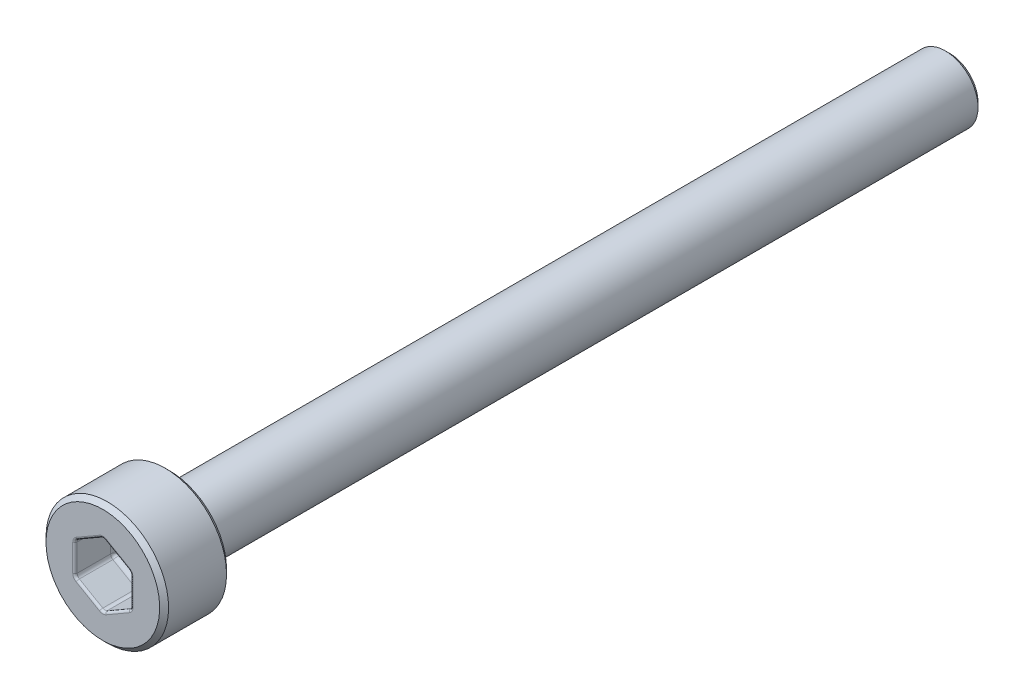
ISO-10303-21;
HEADER;
FILE_DESCRIPTION(('STEP AP214'),'2;1');
FILE_NAME('part.step','',(''),(''),'','','');
FILE_SCHEMA(('AUTOMOTIVE_DESIGN { 1 0 10303 214 1 1 1 1 }'));
ENDSEC;
DATA;
#1=APPLICATION_CONTEXT('core data for automotive mechanical design processes');
#2=APPLICATION_PROTOCOL_DEFINITION('international standard','automotive_design',2000,#1);
#3=PRODUCT_CONTEXT('',#1,'mechanical');
#4=PRODUCT('Part','Part','',(#3));
#5=PRODUCT_RELATED_PRODUCT_CATEGORY('part','',(#4));
#6=PRODUCT_DEFINITION_FORMATION('','',#4);
#7=PRODUCT_DEFINITION_CONTEXT('part definition',#1,'design');
#8=PRODUCT_DEFINITION('design','',#6,#7);
#9=PRODUCT_DEFINITION_SHAPE('','',#8);
#10=(LENGTH_UNIT() NAMED_UNIT(*) SI_UNIT(.MILLI.,.METRE.));
#11=(NAMED_UNIT(*) PLANE_ANGLE_UNIT() SI_UNIT($,.RADIAN.));
#12=(NAMED_UNIT(*) SI_UNIT($,.STERADIAN.) SOLID_ANGLE_UNIT());
#13=UNCERTAINTY_MEASURE_WITH_UNIT(LENGTH_MEASURE(1.E-05),#10,'distance_accuracy_value','');
#14=(GEOMETRIC_REPRESENTATION_CONTEXT(3) GLOBAL_UNCERTAINTY_ASSIGNED_CONTEXT((#13)) GLOBAL_UNIT_ASSIGNED_CONTEXT((#10,
#11,#12)) REPRESENTATION_CONTEXT('',''));
#15=CARTESIAN_POINT('',(0.,0.,0.));
#16=DIRECTION('',(0.,0.,1.));
#17=DIRECTION('',(1.,0.,0.));
#18=AXIS2_PLACEMENT_3D('',#15,#16,#17);
#19=CARTESIAN_POINT('',(0.,0.,3.));
#20=DIRECTION('',(0.,0.,-1.));
#21=DIRECTION('',(-1.,0.,0.));
#22=AXIS2_PLACEMENT_3D('',#19,#20,#21);
#23=PLANE('',#22);
#24=DIRECTION('',(0.,1.,0.));
#25=VECTOR('',#24,1.);
#26=CARTESIAN_POINT('',(1.35,0.,3.));
#27=LINE('',#26,#25);
#28=CARTESIAN_POINT('',(1.35,0.606217782649108,3.));
#29=VERTEX_POINT('',#28);
#30=CARTESIAN_POINT('',(1.35,-0.606217782649109,3.));
#31=VERTEX_POINT('',#30);
#32=EDGE_CURVE('E268',#29,#31,#27,.F.);
#33=ORIENTED_EDGE('',*,*,#32,.T.);
#34=CARTESIAN_POINT('',(1.05,-0.606217782649109,3.));
#35=DIRECTION('',(0.,0.,-1.));
#36=DIRECTION('',(-1.,0.,0.));
#37=AXIS2_PLACEMENT_3D('',#34,#35,#36);
#38=CIRCLE('',#37,0.3);
#39=CARTESIAN_POINT('',(1.2,-0.866025403784441,3.));
#40=VERTEX_POINT('',#39);
#41=EDGE_CURVE('E333',#31,#40,#38,.T.);
#42=ORIENTED_EDGE('',*,*,#41,.T.);
#43=DIRECTION('',(0.866025403784439,0.499999999999999,0.));
#44=VECTOR('',#43,1.);
#45=CARTESIAN_POINT('',(0.675,-1.16913429510899,3.));
#46=LINE('',#45,#44);
#47=CARTESIAN_POINT('',(0.15,-1.47224318643355,3.));
#48=VERTEX_POINT('',#47);
#49=EDGE_CURVE('E331',#40,#48,#46,.F.);
#50=ORIENTED_EDGE('',*,*,#49,.T.);
#51=CARTESIAN_POINT('',(0.,-1.21243556529821,3.));
#52=DIRECTION('',(0.,0.,-1.));
#53=DIRECTION('',(-1.,0.,0.));
#54=AXIS2_PLACEMENT_3D('',#51,#52,#53);
#55=CIRCLE('',#54,0.3);
#56=CARTESIAN_POINT('',(-0.15,-1.47224318643355,3.));
#57=VERTEX_POINT('',#56);
#58=EDGE_CURVE('E329',#48,#57,#55,.T.);
#59=ORIENTED_EDGE('',*,*,#58,.T.);
#60=DIRECTION('',(0.866025403784438,-0.500000000000001,0.));
#61=VECTOR('',#60,1.);
#62=CARTESIAN_POINT('',(-0.675000000000001,-1.16913429510899,3.));
#63=LINE('',#62,#61);
#64=CARTESIAN_POINT('',(-1.2,-0.866025403784438,3.));
#65=VERTEX_POINT('',#64);
#66=EDGE_CURVE('E327',#57,#65,#63,.F.);
#67=ORIENTED_EDGE('',*,*,#66,.T.);
#68=CARTESIAN_POINT('',(-1.05,-0.606217782649107,3.));
#69=DIRECTION('',(0.,0.,-1.));
#70=DIRECTION('',(-1.,0.,0.));
#71=AXIS2_PLACEMENT_3D('',#68,#69,#70);
#72=CIRCLE('',#71,0.3);
#73=CARTESIAN_POINT('',(-1.35,-0.606217782649107,3.));
#74=VERTEX_POINT('',#73);
#75=EDGE_CURVE('E325',#65,#74,#72,.T.);
#76=ORIENTED_EDGE('',*,*,#75,.T.);
#77=DIRECTION('',(0.,-1.,0.));
#78=VECTOR('',#77,1.);
#79=CARTESIAN_POINT('',(-1.35,0.,3.));
#80=LINE('',#79,#78);
#81=CARTESIAN_POINT('',(-1.35,0.606217782649109,3.));
#82=VERTEX_POINT('',#81);
#83=EDGE_CURVE('E323',#74,#82,#80,.F.);
#84=ORIENTED_EDGE('',*,*,#83,.T.);
#85=CARTESIAN_POINT('',(-1.05,0.606217782649109,3.));
#86=DIRECTION('',(0.,0.,-1.));
#87=DIRECTION('',(-1.,0.,0.));
#88=AXIS2_PLACEMENT_3D('',#85,#86,#87);
#89=CIRCLE('',#88,0.3);
#90=CARTESIAN_POINT('',(-1.2,0.86602540378444,3.));
#91=VERTEX_POINT('',#90);
#92=EDGE_CURVE('E321',#82,#91,#89,.T.);
#93=ORIENTED_EDGE('',*,*,#92,.T.);
#94=DIRECTION('',(-0.866025403784439,-0.5,0.));
#95=VECTOR('',#94,1.);
#96=CARTESIAN_POINT('',(-0.675,1.16913429510899,3.));
#97=LINE('',#96,#95);
#98=CARTESIAN_POINT('',(-0.149999999999999,1.47224318643355,3.));
#99=VERTEX_POINT('',#98);
#100=EDGE_CURVE('E319',#91,#99,#97,.F.);
#101=ORIENTED_EDGE('',*,*,#100,.T.);
#102=CARTESIAN_POINT('',(0.,1.21243556529822,3.));
#103=DIRECTION('',(0.,0.,-1.));
#104=DIRECTION('',(-1.,0.,0.));
#105=AXIS2_PLACEMENT_3D('',#102,#103,#104);
#106=CIRCLE('',#105,0.3);
#107=CARTESIAN_POINT('',(0.150000000000001,1.47224318643355,3.));
#108=VERTEX_POINT('',#107);
#109=EDGE_CURVE('E317',#99,#108,#106,.T.);
#110=ORIENTED_EDGE('',*,*,#109,.T.);
#111=DIRECTION('',(-0.866025403784438,0.5,0.));
#112=VECTOR('',#111,1.);
#113=CARTESIAN_POINT('',(0.675000000000001,1.16913429510899,3.));
#114=LINE('',#113,#112);
#115=CARTESIAN_POINT('',(1.2,0.86602540378444,3.));
#116=VERTEX_POINT('',#115);
#117=EDGE_CURVE('E315',#108,#116,#114,.F.);
#118=ORIENTED_EDGE('',*,*,#117,.T.);
#119=CARTESIAN_POINT('',(1.05,0.606217782649108,3.));
#120=DIRECTION('',(0.,0.,-1.));
#121=DIRECTION('',(-1.,0.,0.));
#122=AXIS2_PLACEMENT_3D('',#119,#120,#121);
#123=CIRCLE('',#122,0.3);
#124=EDGE_CURVE('E313',#116,#29,#123,.T.);
#125=ORIENTED_EDGE('',*,*,#124,.T.);
#126=EDGE_LOOP('',(#33,#42,#50,#59,#67,#76,#84,#93,#101,#110,#118,#125));
#127=FACE_BOUND('',#126,.T.);
#128=CARTESIAN_POINT('',(0.,0.,3.));
#129=DIRECTION('',(0.,0.,-1.));
#130=DIRECTION('',(-1.,0.,0.));
#131=AXIS2_PLACEMENT_3D('',#128,#129,#130);
#132=CIRCLE('',#131,2.55);
#133=CARTESIAN_POINT('',(-2.55,0.,3.));
#134=VERTEX_POINT('',#133);
#135=EDGE_CURVE('E311',#134,#134,#132,.F.);
#136=ORIENTED_EDGE('',*,*,#135,.T.);
#137=EDGE_LOOP('',(#136));
#138=FACE_BOUND('',#137,.T.);
#139=ADVANCED_FACE('F39',(#127,#138),#23,.F.);
#140=CARTESIAN_POINT('',(0.,0.,21.9198795180723));
#141=DIRECTION('',(0.,0.,1.));
#142=DIRECTION('',(1.,0.,0.));
#143=AXIS2_PLACEMENT_3D('',#140,#141,#142);
#144=CYLINDRICAL_SURFACE('',#143,2.75);
#145=CARTESIAN_POINT('',(0.,0.,2.8));
#146=DIRECTION('',(0.,0.,-1.));
#147=DIRECTION('',(-1.,0.,0.));
#148=AXIS2_PLACEMENT_3D('',#145,#146,#147);
#149=CIRCLE('',#148,2.75);
#150=CARTESIAN_POINT('',(-2.75,0.,2.8));
#151=VERTEX_POINT('',#150);
#152=EDGE_CURVE('E959',#151,#151,#149,.T.);
#153=ORIENTED_EDGE('',*,*,#152,.T.);
#154=EDGE_LOOP('',(#153));
#155=FACE_BOUND('',#154,.T.);
#156=CARTESIAN_POINT('',(0.,0.,0.200000000000002));
#157=DIRECTION('',(0.,0.,1.));
#158=DIRECTION('',(1.,0.,0.));
#159=AXIS2_PLACEMENT_3D('',#156,#157,#158);
#160=CIRCLE('',#159,2.75);
#161=CARTESIAN_POINT('',(2.75,0.,0.200000000000002));
#162=VERTEX_POINT('',#161);
#163=EDGE_CURVE('E964',#162,#162,#160,.T.);
#164=ORIENTED_EDGE('',*,*,#163,.T.);
#165=EDGE_LOOP('',(#164));
#166=FACE_BOUND('',#165,.T.);
#167=ADVANCED_FACE('F432',(#155,#166),#144,.T.);
#168=CARTESIAN_POINT('',(0.,2.75,0.));
#169=DIRECTION('',(0.,0.,1.));
#170=DIRECTION('',(1.,0.,0.));
#171=AXIS2_PLACEMENT_3D('',#168,#169,#170);
#172=PLANE('',#171);
#173=CARTESIAN_POINT('',(0.,0.,0.));
#174=DIRECTION('',(0.,0.,1.));
#175=DIRECTION('',(1.,0.,0.));
#176=AXIS2_PLACEMENT_3D('',#173,#174,#175);
#177=CIRCLE('',#176,1.665);
#178=CARTESIAN_POINT('',(1.665,0.,0.));
#179=VERTEX_POINT('',#178);
#180=EDGE_CURVE('E263',#179,#179,#177,.T.);
#181=ORIENTED_EDGE('',*,*,#180,.T.);
#182=EDGE_LOOP('',(#181));
#183=FACE_BOUND('',#182,.T.);
#184=CARTESIAN_POINT('',(0.,0.,0.));
#185=DIRECTION('',(0.,0.,1.));
#186=DIRECTION('',(1.,0.,0.));
#187=AXIS2_PLACEMENT_3D('',#184,#185,#186);
#188=CIRCLE('',#187,2.55);
#189=CARTESIAN_POINT('',(2.55,0.,0.));
#190=VERTEX_POINT('',#189);
#191=EDGE_CURVE('E957',#190,#190,#188,.F.);
#192=ORIENTED_EDGE('',*,*,#191,.T.);
#193=EDGE_LOOP('',(#192));
#194=FACE_BOUND('',#193,.T.);
#195=ADVANCED_FACE('F438',(#183,#194),#172,.F.);
#196=CARTESIAN_POINT('',(0.,0.,21.9198795180723));
#197=DIRECTION('',(0.,0.,1.));
#198=DIRECTION('',(1.,0.,0.));
#199=AXIS2_PLACEMENT_3D('',#196,#197,#198);
#200=CYLINDRICAL_SURFACE('',#199,1.465);
#201=CARTESIAN_POINT('',(0.,0.,-0.200000000000002));
#202=DIRECTION('',(0.,0.,1.));
#203=DIRECTION('',(1.,0.,0.));
#204=AXIS2_PLACEMENT_3D('',#201,#202,#203);
#205=CIRCLE('',#204,1.465);
#206=CARTESIAN_POINT('',(1.465,0.,-0.200000000000002));
#207=VERTEX_POINT('',#206);
#208=EDGE_CURVE('E266',#207,#207,#205,.F.);
#209=ORIENTED_EDGE('',*,*,#208,.T.);
#210=EDGE_LOOP('',(#209));
#211=FACE_BOUND('',#210,.T.);
#212=CARTESIAN_POINT('',(0.,0.,-34.8));
#213=DIRECTION('',(0.,0.,1.));
#214=DIRECTION('',(1.,0.,0.));
#215=AXIS2_PLACEMENT_3D('',#212,#213,#214);
#216=CIRCLE('',#215,1.465);
#217=CARTESIAN_POINT('',(1.465,0.,-34.8));
#218=VERTEX_POINT('',#217);
#219=EDGE_CURVE('E958',#218,#218,#216,.T.);
#220=ORIENTED_EDGE('',*,*,#219,.T.);
#221=EDGE_LOOP('',(#220));
#222=FACE_BOUND('',#221,.T.);
#223=ADVANCED_FACE('F890',(#211,#222),#200,.T.);
#224=CARTESIAN_POINT('',(0.,1.465,-35.));
#225=DIRECTION('',(0.,0.,1.));
#226=DIRECTION('',(1.,0.,0.));
#227=AXIS2_PLACEMENT_3D('',#224,#225,#226);
#228=PLANE('',#227);
#229=CARTESIAN_POINT('',(0.,0.,-35.));
#230=DIRECTION('',(0.,0.,1.));
#231=DIRECTION('',(1.,0.,0.));
#232=AXIS2_PLACEMENT_3D('',#229,#230,#231);
#233=CIRCLE('',#232,1.26499999999999);
#234=CARTESIAN_POINT('',(1.26499999999999,0.,-35.));
#235=VERTEX_POINT('',#234);
#236=EDGE_CURVE('E213',#235,#235,#233,.F.);
#237=ORIENTED_EDGE('',*,*,#236,.T.);
#238=EDGE_LOOP('',(#237));
#239=FACE_BOUND('',#238,.T.);
#240=ADVANCED_FACE('F880',(#239),#228,.F.);
#241=CARTESIAN_POINT('',(0.,-1.44337567297407,1.2));
#242=DIRECTION('',(0.499999999999999,-0.866025403784439,0.));
#243=DIRECTION('',(0.866025403784439,0.499999999999999,0.));
#244=AXIS2_PLACEMENT_3D('',#241,#242,#243);
#245=PLANE('',#244);
#246=DIRECTION('',(0.,0.,1.));
#247=VECTOR('',#246,1.);
#248=CARTESIAN_POINT('',(0.0999999999999997,-1.3856406460551,3.));
#249=LINE('',#248,#247);
#250=CARTESIAN_POINT('',(0.0999999999999997,-1.3856406460551,1.4));
#251=VERTEX_POINT('',#250);
#252=CARTESIAN_POINT('',(0.0999999999999997,-1.3856406460551,2.9));
#253=VERTEX_POINT('',#252);
#254=EDGE_CURVE('E260',#251,#253,#249,.T.);
#255=ORIENTED_EDGE('',*,*,#254,.T.);
#256=DIRECTION('',(0.866025403784439,0.499999999999999,0.));
#257=VECTOR('',#256,1.);
#258=CARTESIAN_POINT('',(0.,-1.44337567297407,2.9));
#259=LINE('',#258,#257);
#260=CARTESIAN_POINT('',(1.15,-0.779422863405997,2.9));
#261=VERTEX_POINT('',#260);
#262=EDGE_CURVE('E339',#253,#261,#259,.T.);
#263=ORIENTED_EDGE('',*,*,#262,.T.);
#264=DIRECTION('',(0.,0.,1.));
#265=VECTOR('',#264,1.);
#266=CARTESIAN_POINT('',(1.15,-0.779422863405997,1.2));
#267=LINE('',#266,#265);
#268=CARTESIAN_POINT('',(1.15,-0.779422863405997,1.4));
#269=VERTEX_POINT('',#268);
#270=EDGE_CURVE('E256',#261,#269,#267,.F.);
#271=ORIENTED_EDGE('',*,*,#270,.T.);
#272=DIRECTION('',(0.866025403784439,0.499999999999999,0.));
#273=VECTOR('',#272,1.);
#274=CARTESIAN_POINT('',(0.,-1.44337567297407,1.4));
#275=LINE('',#274,#273);
#276=EDGE_CURVE('E258',#269,#251,#275,.F.);
#277=ORIENTED_EDGE('',*,*,#276,.T.);
#278=EDGE_LOOP('',(#255,#263,#271,#277));
#279=FACE_BOUND('',#278,.T.);
#280=ADVANCED_FACE('F869',(#279),#245,.F.);
#281=CARTESIAN_POINT('',(-1.25,-0.721687836487032,1.2));
#282=DIRECTION('',(-0.5,-0.866025403784438,0.));
#283=DIRECTION('',(0.866025403784438,-0.500000000000001,0.));
#284=AXIS2_PLACEMENT_3D('',#281,#282,#283);
#285=PLANE('',#284);
#286=DIRECTION('',(0.,0.,1.));
#287=VECTOR('',#286,1.);
#288=CARTESIAN_POINT('',(-1.15,-0.779422863405994,3.));
#289=LINE('',#288,#287);
#290=CARTESIAN_POINT('',(-1.15,-0.779422863405994,1.4));
#291=VERTEX_POINT('',#290);
#292=CARTESIAN_POINT('',(-1.15,-0.779422863405994,2.9));
#293=VERTEX_POINT('',#292);
#294=EDGE_CURVE('E227',#291,#293,#289,.T.);
#295=ORIENTED_EDGE('',*,*,#294,.T.);
#296=DIRECTION('',(0.866025403784438,-0.500000000000001,0.));
#297=VECTOR('',#296,1.);
#298=CARTESIAN_POINT('',(-1.25,-0.721687836487032,2.9));
#299=LINE('',#298,#297);
#300=CARTESIAN_POINT('',(-0.1,-1.3856406460551,2.9));
#301=VERTEX_POINT('',#300);
#302=EDGE_CURVE('E343',#293,#301,#299,.T.);
#303=ORIENTED_EDGE('',*,*,#302,.T.);
#304=DIRECTION('',(0.,0.,1.));
#305=VECTOR('',#304,1.);
#306=CARTESIAN_POINT('',(-0.1,-1.3856406460551,1.2));
#307=LINE('',#306,#305);
#308=CARTESIAN_POINT('',(-0.1,-1.3856406460551,1.4));
#309=VERTEX_POINT('',#308);
#310=EDGE_CURVE('E219',#301,#309,#307,.F.);
#311=ORIENTED_EDGE('',*,*,#310,.T.);
#312=DIRECTION('',(0.866025403784438,-0.500000000000001,0.));
#313=VECTOR('',#312,1.);
#314=CARTESIAN_POINT('',(-1.25,-0.721687836487032,1.4));
#315=LINE('',#314,#313);
#316=EDGE_CURVE('E190',#309,#291,#315,.F.);
#317=ORIENTED_EDGE('',*,*,#316,.T.);
#318=EDGE_LOOP('',(#295,#303,#311,#317));
#319=FACE_BOUND('',#318,.T.);
#320=ADVANCED_FACE('F859',(#319),#285,.F.);
#321=CARTESIAN_POINT('',(-1.25,0.721687836487034,1.2));
#322=DIRECTION('',(-1.,0.,0.));
#323=DIRECTION('',(0.,-1.,0.));
#324=AXIS2_PLACEMENT_3D('',#321,#322,#323);
#325=PLANE('',#324);
#326=DIRECTION('',(0.,0.,1.));
#327=VECTOR('',#326,1.);
#328=CARTESIAN_POINT('',(-1.25,0.606217782649109,3.));
#329=LINE('',#328,#327);
#330=CARTESIAN_POINT('',(-1.25,0.606217782649109,1.4));
#331=VERTEX_POINT('',#330);
#332=CARTESIAN_POINT('',(-1.25,0.606217782649109,2.9));
#333=VERTEX_POINT('',#332);
#334=EDGE_CURVE('E230',#331,#333,#329,.T.);
#335=ORIENTED_EDGE('',*,*,#334,.T.);
#336=DIRECTION('',(0.,-1.,0.));
#337=VECTOR('',#336,1.);
#338=CARTESIAN_POINT('',(-1.25,0.721687836487034,2.9));
#339=LINE('',#338,#337);
#340=CARTESIAN_POINT('',(-1.25,-0.606217782649107,2.9));
#341=VERTEX_POINT('',#340);
#342=EDGE_CURVE('E347',#333,#341,#339,.T.);
#343=ORIENTED_EDGE('',*,*,#342,.T.);
#344=DIRECTION('',(0.,0.,1.));
#345=VECTOR('',#344,1.);
#346=CARTESIAN_POINT('',(-1.25,-0.606217782649107,1.2));
#347=LINE('',#346,#345);
#348=CARTESIAN_POINT('',(-1.25,-0.606217782649107,1.4));
#349=VERTEX_POINT('',#348);
#350=EDGE_CURVE('E235',#341,#349,#347,.F.);
#351=ORIENTED_EDGE('',*,*,#350,.T.);
#352=DIRECTION('',(0.,-1.,0.));
#353=VECTOR('',#352,1.);
#354=CARTESIAN_POINT('',(-1.25,0.721687836487034,1.4));
#355=LINE('',#354,#353);
#356=EDGE_CURVE('E233',#349,#331,#355,.F.);
#357=ORIENTED_EDGE('',*,*,#356,.T.);
#358=EDGE_LOOP('',(#335,#343,#351,#357));
#359=FACE_BOUND('',#358,.T.);
#360=ADVANCED_FACE('F407',(#359),#325,.F.);
#361=CARTESIAN_POINT('',(0.,1.44337567297407,1.2));
#362=DIRECTION('',(-0.5,0.866025403784439,0.));
#363=DIRECTION('',(-0.866025403784439,-0.5,0.));
#364=AXIS2_PLACEMENT_3D('',#361,#362,#363);
#365=PLANE('',#364);
#366=DIRECTION('',(0.,0.,1.));
#367=VECTOR('',#366,1.);
#368=CARTESIAN_POINT('',(-0.0999999999999993,1.3856406460551,3.));
#369=LINE('',#368,#367);
#370=CARTESIAN_POINT('',(-0.0999999999999993,1.3856406460551,1.4));
#371=VERTEX_POINT('',#370);
#372=CARTESIAN_POINT('',(-0.0999999999999993,1.3856406460551,2.9));
#373=VERTEX_POINT('',#372);
#374=EDGE_CURVE('E241',#371,#373,#369,.T.);
#375=ORIENTED_EDGE('',*,*,#374,.T.);
#376=DIRECTION('',(-0.866025403784439,-0.5,0.));
#377=VECTOR('',#376,1.);
#378=CARTESIAN_POINT('',(0.,1.44337567297407,2.9));
#379=LINE('',#378,#377);
#380=CARTESIAN_POINT('',(-1.15,0.779422863405996,2.9));
#381=VERTEX_POINT('',#380);
#382=EDGE_CURVE('E351',#373,#381,#379,.T.);
#383=ORIENTED_EDGE('',*,*,#382,.T.);
#384=DIRECTION('',(0.,0.,1.));
#385=VECTOR('',#384,1.);
#386=CARTESIAN_POINT('',(-1.15,0.779422863405996,1.2));
#387=LINE('',#386,#385);
#388=CARTESIAN_POINT('',(-1.15,0.779422863405996,1.4));
#389=VERTEX_POINT('',#388);
#390=EDGE_CURVE('E237',#381,#389,#387,.F.);
#391=ORIENTED_EDGE('',*,*,#390,.T.);
#392=DIRECTION('',(-0.866025403784439,-0.5,0.));
#393=VECTOR('',#392,1.);
#394=CARTESIAN_POINT('',(0.,1.44337567297407,1.4));
#395=LINE('',#394,#393);
#396=EDGE_CURVE('E239',#389,#371,#395,.F.);
#397=ORIENTED_EDGE('',*,*,#396,.T.);
#398=EDGE_LOOP('',(#375,#383,#391,#397));
#399=FACE_BOUND('',#398,.T.);
#400=ADVANCED_FACE('F838',(#399),#365,.F.);
#401=CARTESIAN_POINT('',(1.25,0.721687836487033,1.2));
#402=DIRECTION('',(0.5,0.866025403784438,0.));
#403=DIRECTION('',(-0.866025403784438,0.5,0.));
#404=AXIS2_PLACEMENT_3D('',#401,#402,#403);
#405=PLANE('',#404);
#406=DIRECTION('',(0.,0.,1.));
#407=VECTOR('',#406,1.);
#408=CARTESIAN_POINT('',(1.15,0.779422863405996,3.));
#409=LINE('',#408,#407);
#410=CARTESIAN_POINT('',(1.15,0.779422863405996,1.4));
#411=VERTEX_POINT('',#410);
#412=CARTESIAN_POINT('',(1.15,0.779422863405996,2.9));
#413=VERTEX_POINT('',#412);
#414=EDGE_CURVE('E248',#411,#413,#409,.T.);
#415=ORIENTED_EDGE('',*,*,#414,.T.);
#416=DIRECTION('',(-0.866025403784438,0.5,0.));
#417=VECTOR('',#416,1.);
#418=CARTESIAN_POINT('',(1.25,0.721687836487033,2.9));
#419=LINE('',#418,#417);
#420=CARTESIAN_POINT('',(0.100000000000001,1.3856406460551,2.9));
#421=VERTEX_POINT('',#420);
#422=EDGE_CURVE('E355',#413,#421,#419,.T.);
#423=ORIENTED_EDGE('',*,*,#422,.T.);
#424=DIRECTION('',(0.,0.,1.));
#425=VECTOR('',#424,1.);
#426=CARTESIAN_POINT('',(0.100000000000001,1.3856406460551,1.2));
#427=LINE('',#426,#425);
#428=CARTESIAN_POINT('',(0.100000000000001,1.3856406460551,1.4));
#429=VERTEX_POINT('',#428);
#430=EDGE_CURVE('E244',#421,#429,#427,.F.);
#431=ORIENTED_EDGE('',*,*,#430,.T.);
#432=DIRECTION('',(-0.866025403784438,0.5,0.));
#433=VECTOR('',#432,1.);
#434=CARTESIAN_POINT('',(1.25,0.721687836487033,1.4));
#435=LINE('',#434,#433);
#436=EDGE_CURVE('E246',#429,#411,#435,.F.);
#437=ORIENTED_EDGE('',*,*,#436,.T.);
#438=EDGE_LOOP('',(#415,#423,#431,#437));
#439=FACE_BOUND('',#438,.T.);
#440=ADVANCED_FACE('F828',(#439),#405,.F.);
#441=CARTESIAN_POINT('',(1.25,-0.721687836487034,1.2));
#442=DIRECTION('',(1.,0.,0.));
#443=DIRECTION('',(0.,1.,0.));
#444=AXIS2_PLACEMENT_3D('',#441,#442,#443);
#445=PLANE('',#444);
#446=DIRECTION('',(0.,0.,1.));
#447=VECTOR('',#446,1.);
#448=CARTESIAN_POINT('',(1.25,-0.606217782649109,3.));
#449=LINE('',#448,#447);
#450=CARTESIAN_POINT('',(1.25,-0.606217782649109,1.4));
#451=VERTEX_POINT('',#450);
#452=CARTESIAN_POINT('',(1.25,-0.606217782649109,2.9));
#453=VERTEX_POINT('',#452);
#454=EDGE_CURVE('E254',#451,#453,#449,.T.);
#455=ORIENTED_EDGE('',*,*,#454,.T.);
#456=DIRECTION('',(0.,1.,0.));
#457=VECTOR('',#456,1.);
#458=CARTESIAN_POINT('',(1.25,-0.721687836487034,2.9));
#459=LINE('',#458,#457);
#460=CARTESIAN_POINT('',(1.25,0.606217782649108,2.9));
#461=VERTEX_POINT('',#460);
#462=EDGE_CURVE('E11',#453,#461,#459,.T.);
#463=ORIENTED_EDGE('',*,*,#462,.T.);
#464=DIRECTION('',(0.,0.,1.));
#465=VECTOR('',#464,1.);
#466=CARTESIAN_POINT('',(1.25,0.606217782649108,1.2));
#467=LINE('',#466,#465);
#468=CARTESIAN_POINT('',(1.25,0.606217782649108,1.4));
#469=VERTEX_POINT('',#468);
#470=EDGE_CURVE('E250',#461,#469,#467,.F.);
#471=ORIENTED_EDGE('',*,*,#470,.T.);
#472=DIRECTION('',(0.,1.,0.));
#473=VECTOR('',#472,1.);
#474=CARTESIAN_POINT('',(1.25,-0.721687836487034,1.4));
#475=LINE('',#474,#473);
#476=EDGE_CURVE('E252',#469,#451,#475,.F.);
#477=ORIENTED_EDGE('',*,*,#476,.T.);
#478=EDGE_LOOP('',(#455,#463,#471,#477));
#479=FACE_BOUND('',#478,.T.);
#480=ADVANCED_FACE('F818',(#479),#445,.F.);
#481=CARTESIAN_POINT('',(0.,0.,1.2));
#482=DIRECTION('',(0.,0.,1.));
#483=DIRECTION('',(1.,0.,0.));
#484=AXIS2_PLACEMENT_3D('',#481,#482,#483);
#485=PLANE('',#484);
#486=DIRECTION('',(0.,-1.,0.));
#487=VECTOR('',#486,1.);
#488=CARTESIAN_POINT('',(-1.05,0.,1.2));
#489=LINE('',#488,#487);
#490=CARTESIAN_POINT('',(-1.05,0.606217782649109,1.2));
#491=VERTEX_POINT('',#490);
#492=CARTESIAN_POINT('',(-1.05,-0.606217782649107,1.2));
#493=VERTEX_POINT('',#492);
#494=EDGE_CURVE('E217',#491,#493,#489,.T.);
#495=ORIENTED_EDGE('',*,*,#494,.T.);
#496=DIRECTION('',(0.866025403784438,-0.500000000000001,0.));
#497=VECTOR('',#496,1.);
#498=CARTESIAN_POINT('',(-0.525000000000001,-0.909326673973661,1.2));
#499=LINE('',#498,#497);
#500=CARTESIAN_POINT('',(0.,-1.21243556529822,1.2));
#501=VERTEX_POINT('',#500);
#502=EDGE_CURVE('E188',#493,#501,#499,.T.);
#503=ORIENTED_EDGE('',*,*,#502,.T.);
#504=DIRECTION('',(0.866025403784439,0.499999999999999,0.));
#505=VECTOR('',#504,1.);
#506=CARTESIAN_POINT('',(0.525,-0.909326673973662,1.2));
#507=LINE('',#506,#505);
#508=CARTESIAN_POINT('',(1.05,-0.606217782649109,1.2));
#509=VERTEX_POINT('',#508);
#510=EDGE_CURVE('E206',#501,#509,#507,.T.);
#511=ORIENTED_EDGE('',*,*,#510,.T.);
#512=DIRECTION('',(0.,1.,0.));
#513=VECTOR('',#512,1.);
#514=CARTESIAN_POINT('',(1.05,0.,1.2));
#515=LINE('',#514,#513);
#516=CARTESIAN_POINT('',(1.05,0.606217782649108,1.2));
#517=VERTEX_POINT('',#516);
#518=EDGE_CURVE('E212',#509,#517,#515,.T.);
#519=ORIENTED_EDGE('',*,*,#518,.T.);
#520=DIRECTION('',(-0.866025403784438,0.5,0.));
#521=VECTOR('',#520,1.);
#522=CARTESIAN_POINT('',(0.525000000000001,0.909326673973661,1.2));
#523=LINE('',#522,#521);
#524=CARTESIAN_POINT('',(0.,1.21243556529822,1.2));
#525=VERTEX_POINT('',#524);
#526=EDGE_CURVE('E971',#517,#525,#523,.T.);
#527=ORIENTED_EDGE('',*,*,#526,.T.);
#528=DIRECTION('',(-0.866025403784439,-0.5,0.));
#529=VECTOR('',#528,1.);
#530=CARTESIAN_POINT('',(-0.525,0.909326673973662,1.2));
#531=LINE('',#530,#529);
#532=EDGE_CURVE('E222',#525,#491,#531,.T.);
#533=ORIENTED_EDGE('',*,*,#532,.T.);
#534=EDGE_LOOP('',(#495,#503,#511,#519,#527,#533));
#535=FACE_BOUND('',#534,.T.);
#536=ADVANCED_FACE('F215',(#535),#485,.T.);
#537=CARTESIAN_POINT('',(0.,0.,3.));
#538=DIRECTION('',(0.,0.,-1.));
#539=DIRECTION('',(-1.,0.,0.));
#540=AXIS2_PLACEMENT_3D('',#537,#538,#539);
#541=CONICAL_SURFACE('',#540,2.55,0.785398163397442);
#542=ORIENTED_EDGE('',*,*,#152,.F.);
#543=EDGE_LOOP('',(#542));
#544=FACE_BOUND('',#543,.T.);
#545=ORIENTED_EDGE('',*,*,#135,.F.);
#546=EDGE_LOOP('',(#545));
#547=FACE_BOUND('',#546,.T.);
#548=ADVANCED_FACE('F444',(#544,#547),#541,.T.);
#549=CARTESIAN_POINT('',(0.,0.,0.200000000000002));
#550=DIRECTION('',(0.,0.,1.));
#551=DIRECTION('',(1.,0.,0.));
#552=AXIS2_PLACEMENT_3D('',#549,#550,#551);
#553=CONICAL_SURFACE('',#552,2.75,0.78539816339745);
#554=ORIENTED_EDGE('',*,*,#191,.F.);
#555=EDGE_LOOP('',(#554));
#556=FACE_BOUND('',#555,.T.);
#557=ORIENTED_EDGE('',*,*,#163,.F.);
#558=EDGE_LOOP('',(#557));
#559=FACE_BOUND('',#558,.T.);
#560=ADVANCED_FACE('F447',(#556,#559),#553,.T.);
#561=CARTESIAN_POINT('',(0.,0.,-34.8));
#562=DIRECTION('',(0.,0.,1.));
#563=DIRECTION('',(1.,0.,0.));
#564=AXIS2_PLACEMENT_3D('',#561,#562,#563);
#565=CONICAL_SURFACE('',#564,1.465,0.785398163397429);
#566=ORIENTED_EDGE('',*,*,#236,.F.);
#567=EDGE_LOOP('',(#566));
#568=FACE_BOUND('',#567,.T.);
#569=ORIENTED_EDGE('',*,*,#219,.F.);
#570=EDGE_LOOP('',(#569));
#571=FACE_BOUND('',#570,.T.);
#572=ADVANCED_FACE('F451',(#568,#571),#565,.T.);
#573=CARTESIAN_POINT('',(0.,1.21243556529822,1.2));
#574=DIRECTION('',(0.,0.,-1.));
#575=DIRECTION('',(-1.,0.,0.));
#576=AXIS2_PLACEMENT_3D('',#573,#574,#575);
#577=CYLINDRICAL_SURFACE('',#576,0.2);
#578=ORIENTED_EDGE('',*,*,#430,.F.);
#579=CARTESIAN_POINT('',(0.,1.21243556529822,2.9));
#580=DIRECTION('',(0.,0.,-1.));
#581=DIRECTION('',(-1.,0.,0.));
#582=AXIS2_PLACEMENT_3D('',#579,#580,#581);
#583=CIRCLE('',#582,0.2);
#584=EDGE_CURVE('E353',#421,#373,#583,.F.);
#585=ORIENTED_EDGE('',*,*,#584,.T.);
#586=ORIENTED_EDGE('',*,*,#374,.F.);
#587=CARTESIAN_POINT('',(0.,1.21243556529822,1.4));
#588=DIRECTION('',(0.,0.,1.));
#589=DIRECTION('',(1.,0.,0.));
#590=AXIS2_PLACEMENT_3D('',#587,#588,#589);
#591=CIRCLE('',#590,0.2);
#592=EDGE_CURVE('E308',#429,#371,#591,.T.);
#593=ORIENTED_EDGE('',*,*,#592,.F.);
#594=EDGE_LOOP('',(#578,#585,#586,#593));
#595=FACE_BOUND('',#594,.T.);
#596=ADVANCED_FACE('F455',(#595),#577,.F.);
#597=CARTESIAN_POINT('',(0.525000000000001,0.909326673973661,1.4));
#598=DIRECTION('',(-0.866025403784438,0.5,0.));
#599=DIRECTION('',(-0.5,-0.866025403784438,0.));
#600=AXIS2_PLACEMENT_3D('',#597,#598,#599);
#601=CYLINDRICAL_SURFACE('',#600,0.2);
#602=CARTESIAN_POINT('',(1.05,0.606217782649108,1.4));
#603=DIRECTION('',(-0.866025403784438,0.5,0.));
#604=DIRECTION('',(-0.5,-0.866025403784439,0.));
#605=AXIS2_PLACEMENT_3D('',#602,#603,#604);
#606=CIRCLE('',#605,0.2);
#607=EDGE_CURVE('E302',#411,#517,#606,.T.);
#608=ORIENTED_EDGE('',*,*,#607,.F.);
#609=ORIENTED_EDGE('',*,*,#436,.F.);
#610=CARTESIAN_POINT('',(0.,1.21243556529822,1.4));
#611=DIRECTION('',(0.866025403784438,-0.500000000000001,0.));
#612=DIRECTION('',(0.500000000000001,0.866025403784438,0.));
#613=AXIS2_PLACEMENT_3D('',#610,#611,#612);
#614=CIRCLE('',#613,0.2);
#615=EDGE_CURVE('E305',#525,#429,#614,.T.);
#616=ORIENTED_EDGE('',*,*,#615,.F.);
#617=ORIENTED_EDGE('',*,*,#526,.F.);
#618=EDGE_LOOP('',(#608,#609,#616,#617));
#619=FACE_BOUND('',#618,.T.);
#620=ADVANCED_FACE('F767',(#619),#601,.F.);
#621=CARTESIAN_POINT('',(1.05,0.606217782649108,1.2));
#622=DIRECTION('',(0.,0.,-1.));
#623=DIRECTION('',(-1.,0.,0.));
#624=AXIS2_PLACEMENT_3D('',#621,#622,#623);
#625=CYLINDRICAL_SURFACE('',#624,0.2);
#626=ORIENTED_EDGE('',*,*,#470,.F.);
#627=CARTESIAN_POINT('',(1.05,0.606217782649108,2.9));
#628=DIRECTION('',(0.,0.,-1.));
#629=DIRECTION('',(-1.,0.,0.));
#630=AXIS2_PLACEMENT_3D('',#627,#628,#629);
#631=CIRCLE('',#630,0.2);
#632=EDGE_CURVE('E48',#461,#413,#631,.F.);
#633=ORIENTED_EDGE('',*,*,#632,.T.);
#634=ORIENTED_EDGE('',*,*,#414,.F.);
#635=CARTESIAN_POINT('',(1.05,0.606217782649108,1.4));
#636=DIRECTION('',(0.,0.,1.));
#637=DIRECTION('',(1.,0.,0.));
#638=AXIS2_PLACEMENT_3D('',#635,#636,#637);
#639=CIRCLE('',#638,0.2);
#640=EDGE_CURVE('E299',#469,#411,#639,.T.);
#641=ORIENTED_EDGE('',*,*,#640,.F.);
#642=EDGE_LOOP('',(#626,#633,#634,#641));
#643=FACE_BOUND('',#642,.T.);
#644=ADVANCED_FACE('F756',(#643),#625,.F.);
#645=CARTESIAN_POINT('',(0.,1.21243556529822,1.4));
#646=DIRECTION('',(0.,0.,1.));
#647=DIRECTION('',(1.,0.,0.));
#648=AXIS2_PLACEMENT_3D('',#645,#646,#647);
#649=SPHERICAL_SURFACE('',#648,0.2);
#650=ORIENTED_EDGE('',*,*,#615,.T.);
#651=ORIENTED_EDGE('',*,*,#592,.T.);
#652=CARTESIAN_POINT('',(0.,1.21243556529822,1.4));
#653=DIRECTION('',(-0.866025403784439,-0.5,0.));
#654=DIRECTION('',(0.5,-0.866025403784439,0.));
#655=AXIS2_PLACEMENT_3D('',#652,#653,#654);
#656=CIRCLE('',#655,0.2);
#657=EDGE_CURVE('E296',#525,#371,#656,.F.);
#658=ORIENTED_EDGE('',*,*,#657,.F.);
#659=EDGE_LOOP('',(#650,#651,#658));
#660=FACE_BOUND('',#659,.T.);
#661=ADVANCED_FACE('F745',(#660),#649,.F.);
#662=CARTESIAN_POINT('',(1.05,0.606217782649108,1.4));
#663=DIRECTION('',(0.,0.,1.));
#664=DIRECTION('',(1.,0.,0.));
#665=AXIS2_PLACEMENT_3D('',#662,#663,#664);
#666=SPHERICAL_SURFACE('',#665,0.2);
#667=ORIENTED_EDGE('',*,*,#640,.T.);
#668=ORIENTED_EDGE('',*,*,#607,.T.);
#669=CARTESIAN_POINT('',(1.05,0.606217782649108,1.4));
#670=DIRECTION('',(0.,-1.,0.));
#671=DIRECTION('',(0.,0.,-1.));
#672=AXIS2_PLACEMENT_3D('',#669,#670,#671);
#673=CIRCLE('',#672,0.2);
#674=EDGE_CURVE('E293',#469,#517,#673,.F.);
#675=ORIENTED_EDGE('',*,*,#674,.F.);
#676=EDGE_LOOP('',(#667,#668,#675));
#677=FACE_BOUND('',#676,.T.);
#678=ADVANCED_FACE('F735',(#677),#666,.F.);
#679=CARTESIAN_POINT('',(-1.05,0.606217782649109,1.2));
#680=DIRECTION('',(0.,0.,-1.));
#681=DIRECTION('',(-1.,0.,0.));
#682=AXIS2_PLACEMENT_3D('',#679,#680,#681);
#683=CYLINDRICAL_SURFACE('',#682,0.2);
#684=ORIENTED_EDGE('',*,*,#390,.F.);
#685=CARTESIAN_POINT('',(-1.05,0.606217782649109,2.9));
#686=DIRECTION('',(0.,0.,-1.));
#687=DIRECTION('',(-1.,0.,0.));
#688=AXIS2_PLACEMENT_3D('',#685,#686,#687);
#689=CIRCLE('',#688,0.2);
#690=EDGE_CURVE('E349',#381,#333,#689,.F.);
#691=ORIENTED_EDGE('',*,*,#690,.T.);
#692=ORIENTED_EDGE('',*,*,#334,.F.);
#693=CARTESIAN_POINT('',(-1.05,0.606217782649109,1.4));
#694=DIRECTION('',(0.,0.,1.));
#695=DIRECTION('',(1.,0.,0.));
#696=AXIS2_PLACEMENT_3D('',#693,#694,#695);
#697=CIRCLE('',#696,0.2);
#698=EDGE_CURVE('E290',#389,#331,#697,.T.);
#699=ORIENTED_EDGE('',*,*,#698,.F.);
#700=EDGE_LOOP('',(#684,#691,#692,#699));
#701=FACE_BOUND('',#700,.T.);
#702=ADVANCED_FACE('F404',(#701),#683,.F.);
#703=CARTESIAN_POINT('',(-0.525,0.909326673973662,1.4));
#704=DIRECTION('',(-0.866025403784439,-0.5,0.));
#705=DIRECTION('',(0.5,-0.866025403784439,0.));
#706=AXIS2_PLACEMENT_3D('',#703,#704,#705);
#707=CYLINDRICAL_SURFACE('',#706,0.2);
#708=ORIENTED_EDGE('',*,*,#657,.T.);
#709=ORIENTED_EDGE('',*,*,#396,.F.);
#710=CARTESIAN_POINT('',(-1.05,0.606217782649109,1.4));
#711=DIRECTION('',(0.866025403784438,0.5,0.));
#712=DIRECTION('',(-0.5,0.866025403784438,0.));
#713=AXIS2_PLACEMENT_3D('',#710,#711,#712);
#714=CIRCLE('',#713,0.2);
#715=EDGE_CURVE('E287',#491,#389,#714,.T.);
#716=ORIENTED_EDGE('',*,*,#715,.F.);
#717=ORIENTED_EDGE('',*,*,#532,.F.);
#718=EDGE_LOOP('',(#708,#709,#716,#717));
#719=FACE_BOUND('',#718,.T.);
#720=ADVANCED_FACE('F714',(#719),#707,.F.);
#721=CARTESIAN_POINT('',(1.05,0.,1.4));
#722=DIRECTION('',(0.,1.,0.));
#723=DIRECTION('',(-1.,0.,0.));
#724=AXIS2_PLACEMENT_3D('',#721,#722,#723);
#725=CYLINDRICAL_SURFACE('',#724,0.2);
#726=ORIENTED_EDGE('',*,*,#674,.T.);
#727=ORIENTED_EDGE('',*,*,#518,.F.);
#728=CARTESIAN_POINT('',(1.05,-0.606217782649109,1.4));
#729=DIRECTION('',(0.,1.,0.));
#730=DIRECTION('',(0.,0.,1.));
#731=AXIS2_PLACEMENT_3D('',#728,#729,#730);
#732=CIRCLE('',#731,0.2);
#733=EDGE_CURVE('E284',#451,#509,#732,.T.);
#734=ORIENTED_EDGE('',*,*,#733,.F.);
#735=ORIENTED_EDGE('',*,*,#476,.F.);
#736=EDGE_LOOP('',(#726,#727,#734,#735));
#737=FACE_BOUND('',#736,.T.);
#738=ADVANCED_FACE('F703',(#737),#725,.F.);
#739=CARTESIAN_POINT('',(1.05,-0.606217782649109,1.2));
#740=DIRECTION('',(0.,0.,-1.));
#741=DIRECTION('',(-1.,0.,0.));
#742=AXIS2_PLACEMENT_3D('',#739,#740,#741);
#743=CYLINDRICAL_SURFACE('',#742,0.2);
#744=ORIENTED_EDGE('',*,*,#270,.F.);
#745=CARTESIAN_POINT('',(1.05,-0.606217782649109,2.9));
#746=DIRECTION('',(0.,0.,-1.));
#747=DIRECTION('',(-1.,0.,0.));
#748=AXIS2_PLACEMENT_3D('',#745,#746,#747);
#749=CIRCLE('',#748,0.2);
#750=EDGE_CURVE('E336',#261,#453,#749,.F.);
#751=ORIENTED_EDGE('',*,*,#750,.T.);
#752=ORIENTED_EDGE('',*,*,#454,.F.);
#753=CARTESIAN_POINT('',(1.05,-0.606217782649109,1.4));
#754=DIRECTION('',(0.,0.,1.));
#755=DIRECTION('',(1.,0.,0.));
#756=AXIS2_PLACEMENT_3D('',#753,#754,#755);
#757=CIRCLE('',#756,0.2);
#758=EDGE_CURVE('E281',#269,#451,#757,.T.);
#759=ORIENTED_EDGE('',*,*,#758,.F.);
#760=EDGE_LOOP('',(#744,#751,#752,#759));
#761=FACE_BOUND('',#760,.T.);
#762=ADVANCED_FACE('F692',(#761),#743,.F.);
#763=CARTESIAN_POINT('',(-1.05,0.606217782649109,1.4));
#764=DIRECTION('',(0.,0.,1.));
#765=DIRECTION('',(1.,0.,0.));
#766=AXIS2_PLACEMENT_3D('',#763,#764,#765);
#767=SPHERICAL_SURFACE('',#766,0.2);
#768=ORIENTED_EDGE('',*,*,#715,.T.);
#769=ORIENTED_EDGE('',*,*,#698,.T.);
#770=CARTESIAN_POINT('',(-1.05,0.606217782649109,1.4));
#771=DIRECTION('',(0.,-1.,0.));
#772=DIRECTION('',(0.,0.,-1.));
#773=AXIS2_PLACEMENT_3D('',#770,#771,#772);
#774=CIRCLE('',#773,0.2);
#775=EDGE_CURVE('E278',#491,#331,#774,.F.);
#776=ORIENTED_EDGE('',*,*,#775,.F.);
#777=EDGE_LOOP('',(#768,#769,#776));
#778=FACE_BOUND('',#777,.T.);
#779=ADVANCED_FACE('F681',(#778),#767,.F.);
#780=CARTESIAN_POINT('',(1.05,-0.606217782649109,1.4));
#781=DIRECTION('',(0.,0.,1.));
#782=DIRECTION('',(1.,0.,0.));
#783=AXIS2_PLACEMENT_3D('',#780,#781,#782);
#784=SPHERICAL_SURFACE('',#783,0.2);
#785=ORIENTED_EDGE('',*,*,#758,.T.);
#786=ORIENTED_EDGE('',*,*,#733,.T.);
#787=CARTESIAN_POINT('',(1.05,-0.606217782649109,1.4));
#788=DIRECTION('',(-0.866025403784439,-0.5,0.));
#789=DIRECTION('',(0.5,-0.866025403784439,0.));
#790=AXIS2_PLACEMENT_3D('',#787,#788,#789);
#791=CIRCLE('',#790,0.2);
#792=EDGE_CURVE('E209',#269,#509,#791,.F.);
#793=ORIENTED_EDGE('',*,*,#792,.F.);
#794=EDGE_LOOP('',(#785,#786,#793));
#795=FACE_BOUND('',#794,.T.);
#796=ADVANCED_FACE('F671',(#795),#784,.F.);
#797=CARTESIAN_POINT('',(-1.05,-0.606217782649107,1.2));
#798=DIRECTION('',(0.,0.,-1.));
#799=DIRECTION('',(-1.,0.,0.));
#800=AXIS2_PLACEMENT_3D('',#797,#798,#799);
#801=CYLINDRICAL_SURFACE('',#800,0.2);
#802=ORIENTED_EDGE('',*,*,#350,.F.);
#803=CARTESIAN_POINT('',(-1.05,-0.606217782649107,2.9));
#804=DIRECTION('',(0.,0.,-1.));
#805=DIRECTION('',(-1.,0.,0.));
#806=AXIS2_PLACEMENT_3D('',#803,#804,#805);
#807=CIRCLE('',#806,0.2);
#808=EDGE_CURVE('E345',#341,#293,#807,.F.);
#809=ORIENTED_EDGE('',*,*,#808,.T.);
#810=ORIENTED_EDGE('',*,*,#294,.F.);
#811=CARTESIAN_POINT('',(-1.05,-0.606217782649107,1.4));
#812=DIRECTION('',(0.,0.,1.));
#813=DIRECTION('',(1.,0.,0.));
#814=AXIS2_PLACEMENT_3D('',#811,#812,#813);
#815=CIRCLE('',#814,0.2);
#816=EDGE_CURVE('E274',#349,#291,#815,.T.);
#817=ORIENTED_EDGE('',*,*,#816,.F.);
#818=EDGE_LOOP('',(#802,#809,#810,#817));
#819=FACE_BOUND('',#818,.T.);
#820=ADVANCED_FACE('F417',(#819),#801,.F.);
#821=CARTESIAN_POINT('',(-1.05,0.,1.4));
#822=DIRECTION('',(0.,-1.,0.));
#823=DIRECTION('',(1.,0.,0.));
#824=AXIS2_PLACEMENT_3D('',#821,#822,#823);
#825=CYLINDRICAL_SURFACE('',#824,0.2);
#826=ORIENTED_EDGE('',*,*,#775,.T.);
#827=ORIENTED_EDGE('',*,*,#356,.F.);
#828=CARTESIAN_POINT('',(-1.05,-0.606217782649107,1.4));
#829=DIRECTION('',(0.,1.,0.));
#830=DIRECTION('',(-1.,0.,0.));
#831=AXIS2_PLACEMENT_3D('',#828,#829,#830);
#832=CIRCLE('',#831,0.2);
#833=EDGE_CURVE('E203',#493,#349,#832,.T.);
#834=ORIENTED_EDGE('',*,*,#833,.F.);
#835=ORIENTED_EDGE('',*,*,#494,.F.);
#836=EDGE_LOOP('',(#826,#827,#834,#835));
#837=FACE_BOUND('',#836,.T.);
#838=ADVANCED_FACE('F412',(#837),#825,.F.);
#839=CARTESIAN_POINT('',(0.525,-0.909326673973662,1.4));
#840=DIRECTION('',(0.866025403784439,0.499999999999999,0.));
#841=DIRECTION('',(-0.499999999999999,0.866025403784439,0.));
#842=AXIS2_PLACEMENT_3D('',#839,#840,#841);
#843=CYLINDRICAL_SURFACE('',#842,0.2);
#844=ORIENTED_EDGE('',*,*,#792,.T.);
#845=ORIENTED_EDGE('',*,*,#510,.F.);
#846=CARTESIAN_POINT('',(0.,-1.21243556529821,1.4));
#847=DIRECTION('',(0.866025403784439,0.499999999999999,0.));
#848=DIRECTION('',(-0.499999999999999,0.866025403784439,0.));
#849=AXIS2_PLACEMENT_3D('',#846,#847,#848);
#850=CIRCLE('',#849,0.2);
#851=EDGE_CURVE('E196',#251,#501,#850,.T.);
#852=ORIENTED_EDGE('',*,*,#851,.F.);
#853=ORIENTED_EDGE('',*,*,#276,.F.);
#854=EDGE_LOOP('',(#844,#845,#852,#853));
#855=FACE_BOUND('',#854,.T.);
#856=ADVANCED_FACE('F207',(#855),#843,.F.);
#857=CARTESIAN_POINT('',(0.,-1.21243556529821,1.2));
#858=DIRECTION('',(0.,0.,-1.));
#859=DIRECTION('',(-1.,0.,0.));
#860=AXIS2_PLACEMENT_3D('',#857,#858,#859);
#861=CYLINDRICAL_SURFACE('',#860,0.2);
#862=ORIENTED_EDGE('',*,*,#310,.F.);
#863=CARTESIAN_POINT('',(0.,-1.21243556529821,2.9));
#864=DIRECTION('',(0.,0.,-1.));
#865=DIRECTION('',(-1.,0.,0.));
#866=AXIS2_PLACEMENT_3D('',#863,#864,#865);
#867=CIRCLE('',#866,0.2);
#868=EDGE_CURVE('E341',#301,#253,#867,.F.);
#869=ORIENTED_EDGE('',*,*,#868,.T.);
#870=ORIENTED_EDGE('',*,*,#254,.F.);
#871=CARTESIAN_POINT('',(0.,-1.21243556529821,1.4));
#872=DIRECTION('',(0.,0.,1.));
#873=DIRECTION('',(1.,0.,0.));
#874=AXIS2_PLACEMENT_3D('',#871,#872,#873);
#875=CIRCLE('',#874,0.2);
#876=EDGE_CURVE('E200',#309,#251,#875,.T.);
#877=ORIENTED_EDGE('',*,*,#876,.F.);
#878=EDGE_LOOP('',(#862,#869,#870,#877));
#879=FACE_BOUND('',#878,.T.);
#880=ADVANCED_FACE('F422',(#879),#861,.F.);
#881=CARTESIAN_POINT('',(-1.05,-0.606217782649107,1.4));
#882=DIRECTION('',(0.,0.,1.));
#883=DIRECTION('',(1.,0.,0.));
#884=AXIS2_PLACEMENT_3D('',#881,#882,#883);
#885=SPHERICAL_SURFACE('',#884,0.2);
#886=ORIENTED_EDGE('',*,*,#833,.T.);
#887=ORIENTED_EDGE('',*,*,#816,.T.);
#888=CARTESIAN_POINT('',(-1.05,-0.606217782649107,1.4));
#889=DIRECTION('',(0.866025403784438,-0.5,0.));
#890=DIRECTION('',(0.5,0.866025403784439,0.));
#891=AXIS2_PLACEMENT_3D('',#888,#889,#890);
#892=CIRCLE('',#891,0.2);
#893=EDGE_CURVE('E193',#493,#291,#892,.F.);
#894=ORIENTED_EDGE('',*,*,#893,.F.);
#895=EDGE_LOOP('',(#886,#887,#894));
#896=FACE_BOUND('',#895,.T.);
#897=ADVANCED_FACE('F420',(#896),#885,.F.);
#898=CARTESIAN_POINT('',(0.,-1.21243556529821,1.4));
#899=DIRECTION('',(0.,0.,1.));
#900=DIRECTION('',(1.,0.,0.));
#901=AXIS2_PLACEMENT_3D('',#898,#899,#900);
#902=SPHERICAL_SURFACE('',#901,0.2);
#903=ORIENTED_EDGE('',*,*,#876,.T.);
#904=ORIENTED_EDGE('',*,*,#851,.T.);
#905=CARTESIAN_POINT('',(0.,-1.21243556529822,1.4));
#906=DIRECTION('',(-0.866025403784438,0.500000000000001,0.));
#907=DIRECTION('',(-0.500000000000002,-0.866025403784438,0.));
#908=AXIS2_PLACEMENT_3D('',#905,#906,#907);
#909=CIRCLE('',#908,0.2);
#910=EDGE_CURVE('E184',#309,#501,#909,.F.);
#911=ORIENTED_EDGE('',*,*,#910,.F.);
#912=EDGE_LOOP('',(#903,#904,#911));
#913=FACE_BOUND('',#912,.T.);
#914=ADVANCED_FACE('F198',(#913),#902,.F.);
#915=CARTESIAN_POINT('',(-0.525000000000001,-0.909326673973661,1.4));
#916=DIRECTION('',(0.866025403784438,-0.500000000000001,0.));
#917=DIRECTION('',(0.500000000000001,0.866025403784438,0.));
#918=AXIS2_PLACEMENT_3D('',#915,#916,#917);
#919=CYLINDRICAL_SURFACE('',#918,0.2);
#920=ORIENTED_EDGE('',*,*,#893,.T.);
#921=ORIENTED_EDGE('',*,*,#316,.F.);
#922=ORIENTED_EDGE('',*,*,#910,.T.);
#923=ORIENTED_EDGE('',*,*,#502,.F.);
#924=EDGE_LOOP('',(#920,#921,#922,#923));
#925=FACE_BOUND('',#924,.T.);
#926=ADVANCED_FACE('F186',(#925),#919,.F.);
#927=CARTESIAN_POINT('',(0.,0.,-0.200000000000002));
#928=DIRECTION('',(0.,0.,1.));
#929=DIRECTION('',(1.,0.,0.));
#930=AXIS2_PLACEMENT_3D('',#927,#928,#929);
#931=TOROIDAL_SURFACE('',#930,1.665,0.2);
#932=ORIENTED_EDGE('',*,*,#208,.F.);
#933=EDGE_LOOP('',(#932));
#934=FACE_BOUND('',#933,.T.);
#935=ORIENTED_EDGE('',*,*,#180,.F.);
#936=EDGE_LOOP('',(#935));
#937=FACE_BOUND('',#936,.T.);
#938=ADVANCED_FACE('F458',(#934,#937),#931,.F.);
#939=CARTESIAN_POINT('',(-1.05,0.606217782649109,2.9));
#940=DIRECTION('',(0.,0.,-1.));
#941=DIRECTION('',(-1.,0.,0.));
#942=AXIS2_PLACEMENT_3D('',#939,#940,#941);
#943=TOROIDAL_SURFACE('',#942,0.3,0.1);
#944=CARTESIAN_POINT('',(-1.35,0.606217782649109,2.9));
#945=DIRECTION('',(0.,-1.,0.));
#946=DIRECTION('',(0.,0.,-1.));
#947=AXIS2_PLACEMENT_3D('',#944,#945,#946);
#948=CIRCLE('',#947,0.1);
#949=EDGE_CURVE('E385',#333,#82,#948,.T.);
#950=ORIENTED_EDGE('',*,*,#949,.F.);
#951=ORIENTED_EDGE('',*,*,#690,.F.);
#952=CARTESIAN_POINT('',(-1.2,0.86602540378444,2.9));
#953=DIRECTION('',(0.866025403784439,0.499999999999999,0.));
#954=DIRECTION('',(-0.499999999999999,0.866025403784439,0.));
#955=AXIS2_PLACEMENT_3D('',#952,#953,#954);
#956=CIRCLE('',#955,0.1);
#957=EDGE_CURVE('E43',#91,#381,#956,.T.);
#958=ORIENTED_EDGE('',*,*,#957,.F.);
#959=ORIENTED_EDGE('',*,*,#92,.F.);
#960=EDGE_LOOP('',(#950,#951,#958,#959));
#961=FACE_BOUND('',#960,.T.);
#962=ADVANCED_FACE('F41',(#961),#943,.T.);
#963=CARTESIAN_POINT('',(-0.0499999999999991,1.52997821335251,2.9));
#964=DIRECTION('',(-0.866025403784439,-0.5,0.));
#965=DIRECTION('',(0.5,-0.866025403784439,0.));
#966=AXIS2_PLACEMENT_3D('',#963,#964,#965);
#967=CYLINDRICAL_SURFACE('',#966,0.1);
#968=ORIENTED_EDGE('',*,*,#957,.T.);
#969=ORIENTED_EDGE('',*,*,#382,.F.);
#970=CARTESIAN_POINT('',(-0.149999999999999,1.47224318643355,2.9));
#971=DIRECTION('',(0.866025403784439,0.5,0.));
#972=DIRECTION('',(-0.5,0.866025403784439,0.));
#973=AXIS2_PLACEMENT_3D('',#970,#971,#972);
#974=CIRCLE('',#973,0.1);
#975=EDGE_CURVE('E383',#99,#373,#974,.T.);
#976=ORIENTED_EDGE('',*,*,#975,.F.);
#977=ORIENTED_EDGE('',*,*,#100,.F.);
#978=EDGE_LOOP('',(#968,#969,#976,#977));
#979=FACE_BOUND('',#978,.T.);
#980=ADVANCED_FACE('F396',(#979),#967,.T.);
#981=CARTESIAN_POINT('',(-1.35,0.721687836487034,2.9));
#982=DIRECTION('',(0.,-1.,0.));
#983=DIRECTION('',(1.,0.,0.));
#984=AXIS2_PLACEMENT_3D('',#981,#982,#983);
#985=CYLINDRICAL_SURFACE('',#984,0.1);
#986=ORIENTED_EDGE('',*,*,#949,.T.);
#987=ORIENTED_EDGE('',*,*,#83,.F.);
#988=CARTESIAN_POINT('',(-1.35,-0.606217782649107,2.9));
#989=DIRECTION('',(0.,-1.,0.));
#990=DIRECTION('',(0.,0.,-1.));
#991=AXIS2_PLACEMENT_3D('',#988,#989,#990);
#992=CIRCLE('',#991,0.1);
#993=EDGE_CURVE('E380',#341,#74,#992,.T.);
#994=ORIENTED_EDGE('',*,*,#993,.F.);
#995=ORIENTED_EDGE('',*,*,#342,.F.);
#996=EDGE_LOOP('',(#986,#987,#994,#995));
#997=FACE_BOUND('',#996,.T.);
#998=ADVANCED_FACE('F507',(#997),#985,.T.);
#999=CARTESIAN_POINT('',(0.,1.21243556529822,2.9));
#1000=DIRECTION('',(0.,0.,-1.));
#1001=DIRECTION('',(-1.,0.,0.));
#1002=AXIS2_PLACEMENT_3D('',#999,#1000,#1001);
#1003=TOROIDAL_SURFACE('',#1002,0.3,0.1);
#1004=ORIENTED_EDGE('',*,*,#975,.T.);
#1005=ORIENTED_EDGE('',*,*,#584,.F.);
#1006=CARTESIAN_POINT('',(0.150000000000001,1.47224318643355,2.9));
#1007=DIRECTION('',(0.866025403784439,-0.5,0.));
#1008=DIRECTION('',(0.5,0.866025403784439,0.));
#1009=AXIS2_PLACEMENT_3D('',#1006,#1007,#1008);
#1010=CIRCLE('',#1009,0.1);
#1011=EDGE_CURVE('E377',#108,#421,#1010,.T.);
#1012=ORIENTED_EDGE('',*,*,#1011,.F.);
#1013=ORIENTED_EDGE('',*,*,#109,.F.);
#1014=EDGE_LOOP('',(#1004,#1005,#1012,#1013));
#1015=FACE_BOUND('',#1014,.T.);
#1016=ADVANCED_FACE('F503',(#1015),#1003,.T.);
#1017=CARTESIAN_POINT('',(-1.05,-0.606217782649107,2.9));
#1018=DIRECTION('',(0.,0.,-1.));
#1019=DIRECTION('',(-1.,0.,0.));
#1020=AXIS2_PLACEMENT_3D('',#1017,#1018,#1019);
#1021=TOROIDAL_SURFACE('',#1020,0.3,0.1);
#1022=ORIENTED_EDGE('',*,*,#993,.T.);
#1023=ORIENTED_EDGE('',*,*,#75,.F.);
#1024=CARTESIAN_POINT('',(-1.2,-0.866025403784438,2.9));
#1025=DIRECTION('',(0.866025403784438,-0.500000000000001,0.));
#1026=DIRECTION('',(0.500000000000001,0.866025403784438,0.));
#1027=AXIS2_PLACEMENT_3D('',#1024,#1025,#1026);
#1028=CIRCLE('',#1027,0.1);
#1029=EDGE_CURVE('E374',#293,#65,#1028,.T.);
#1030=ORIENTED_EDGE('',*,*,#1029,.F.);
#1031=ORIENTED_EDGE('',*,*,#808,.F.);
#1032=EDGE_LOOP('',(#1022,#1023,#1030,#1031));
#1033=FACE_BOUND('',#1032,.T.);
#1034=ADVANCED_FACE('F499',(#1033),#1021,.T.);
#1035=CARTESIAN_POINT('',(1.3,0.808290376865477,2.9));
#1036=DIRECTION('',(-0.866025403784438,0.5,0.));
#1037=DIRECTION('',(-0.5,-0.866025403784438,0.));
#1038=AXIS2_PLACEMENT_3D('',#1035,#1036,#1037);
#1039=CYLINDRICAL_SURFACE('',#1038,0.1);
#1040=ORIENTED_EDGE('',*,*,#1011,.T.);
#1041=ORIENTED_EDGE('',*,*,#422,.F.);
#1042=CARTESIAN_POINT('',(1.2,0.86602540378444,2.9));
#1043=DIRECTION('',(0.866025403784438,-0.500000000000001,0.));
#1044=DIRECTION('',(0.500000000000001,0.866025403784438,0.));
#1045=AXIS2_PLACEMENT_3D('',#1042,#1043,#1044);
#1046=CIRCLE('',#1045,0.1);
#1047=EDGE_CURVE('E371',#116,#413,#1046,.T.);
#1048=ORIENTED_EDGE('',*,*,#1047,.F.);
#1049=ORIENTED_EDGE('',*,*,#117,.F.);
#1050=EDGE_LOOP('',(#1040,#1041,#1048,#1049));
#1051=FACE_BOUND('',#1050,.T.);
#1052=ADVANCED_FACE('F495',(#1051),#1039,.T.);
#1053=CARTESIAN_POINT('',(-1.3,-0.808290376865476,2.9));
#1054=DIRECTION('',(0.866025403784438,-0.500000000000001,0.));
#1055=DIRECTION('',(0.500000000000001,0.866025403784438,0.));
#1056=AXIS2_PLACEMENT_3D('',#1053,#1054,#1055);
#1057=CYLINDRICAL_SURFACE('',#1056,0.1);
#1058=ORIENTED_EDGE('',*,*,#1029,.T.);
#1059=ORIENTED_EDGE('',*,*,#66,.F.);
#1060=CARTESIAN_POINT('',(-0.15,-1.47224318643355,2.9));
#1061=DIRECTION('',(0.866025403784438,-0.5,0.));
#1062=DIRECTION('',(0.5,0.866025403784438,0.));
#1063=AXIS2_PLACEMENT_3D('',#1060,#1061,#1062);
#1064=CIRCLE('',#1063,0.1);
#1065=EDGE_CURVE('E368',#301,#57,#1064,.T.);
#1066=ORIENTED_EDGE('',*,*,#1065,.F.);
#1067=ORIENTED_EDGE('',*,*,#302,.F.);
#1068=EDGE_LOOP('',(#1058,#1059,#1066,#1067));
#1069=FACE_BOUND('',#1068,.T.);
#1070=ADVANCED_FACE('F491',(#1069),#1057,.T.);
#1071=CARTESIAN_POINT('',(1.05,0.606217782649108,2.9));
#1072=DIRECTION('',(0.,0.,-1.));
#1073=DIRECTION('',(-1.,0.,0.));
#1074=AXIS2_PLACEMENT_3D('',#1071,#1072,#1073);
#1075=TOROIDAL_SURFACE('',#1074,0.3,0.1);
#1076=ORIENTED_EDGE('',*,*,#1047,.T.);
#1077=ORIENTED_EDGE('',*,*,#632,.F.);
#1078=CARTESIAN_POINT('',(1.35,0.606217782649108,2.9));
#1079=DIRECTION('',(0.,-1.,0.));
#1080=DIRECTION('',(0.,0.,-1.));
#1081=AXIS2_PLACEMENT_3D('',#1078,#1079,#1080);
#1082=CIRCLE('',#1081,0.1);
#1083=EDGE_CURVE('E365',#29,#461,#1082,.T.);
#1084=ORIENTED_EDGE('',*,*,#1083,.F.);
#1085=ORIENTED_EDGE('',*,*,#124,.F.);
#1086=EDGE_LOOP('',(#1076,#1077,#1084,#1085));
#1087=FACE_BOUND('',#1086,.T.);
#1088=ADVANCED_FACE('F487',(#1087),#1075,.T.);
#1089=CARTESIAN_POINT('',(0.,-1.21243556529821,2.9));
#1090=DIRECTION('',(0.,0.,-1.));
#1091=DIRECTION('',(-1.,0.,0.));
#1092=AXIS2_PLACEMENT_3D('',#1089,#1090,#1091);
#1093=TOROIDAL_SURFACE('',#1092,0.3,0.1);
#1094=ORIENTED_EDGE('',*,*,#1065,.T.);
#1095=ORIENTED_EDGE('',*,*,#58,.F.);
#1096=CARTESIAN_POINT('',(0.15,-1.47224318643355,2.9));
#1097=DIRECTION('',(0.866025403784439,0.499999999999999,0.));
#1098=DIRECTION('',(-0.5,0.866025403784439,0.));
#1099=AXIS2_PLACEMENT_3D('',#1096,#1097,#1098);
#1100=CIRCLE('',#1099,0.1);
#1101=EDGE_CURVE('E362',#253,#48,#1100,.T.);
#1102=ORIENTED_EDGE('',*,*,#1101,.F.);
#1103=ORIENTED_EDGE('',*,*,#868,.F.);
#1104=EDGE_LOOP('',(#1094,#1095,#1102,#1103));
#1105=FACE_BOUND('',#1104,.T.);
#1106=ADVANCED_FACE('F483',(#1105),#1093,.T.);
#1107=CARTESIAN_POINT('',(1.35,-0.721687836487034,2.9));
#1108=DIRECTION('',(0.,1.,0.));
#1109=DIRECTION('',(-1.,0.,0.));
#1110=AXIS2_PLACEMENT_3D('',#1107,#1108,#1109);
#1111=CYLINDRICAL_SURFACE('',#1110,0.1);
#1112=ORIENTED_EDGE('',*,*,#1083,.T.);
#1113=ORIENTED_EDGE('',*,*,#462,.F.);
#1114=CARTESIAN_POINT('',(1.35,-0.606217782649109,2.9));
#1115=DIRECTION('',(0.,-1.,0.));
#1116=DIRECTION('',(0.,0.,-1.));
#1117=AXIS2_PLACEMENT_3D('',#1114,#1115,#1116);
#1118=CIRCLE('',#1117,0.1);
#1119=EDGE_CURVE('E360',#31,#453,#1118,.T.);
#1120=ORIENTED_EDGE('',*,*,#1119,.F.);
#1121=ORIENTED_EDGE('',*,*,#32,.F.);
#1122=EDGE_LOOP('',(#1112,#1113,#1120,#1121));
#1123=FACE_BOUND('',#1122,.T.);
#1124=ADVANCED_FACE('F479',(#1123),#1111,.T.);
#1125=CARTESIAN_POINT('',(0.0499999999999997,-1.52997821335251,2.9));
#1126=DIRECTION('',(0.866025403784439,0.499999999999999,0.));
#1127=DIRECTION('',(-0.499999999999999,0.866025403784439,0.));
#1128=AXIS2_PLACEMENT_3D('',#1125,#1126,#1127);
#1129=CYLINDRICAL_SURFACE('',#1128,0.1);
#1130=ORIENTED_EDGE('',*,*,#1101,.T.);
#1131=ORIENTED_EDGE('',*,*,#49,.F.);
#1132=CARTESIAN_POINT('',(1.2,-0.866025403784441,2.9));
#1133=DIRECTION('',(0.866025403784439,0.499999999999999,0.));
#1134=DIRECTION('',(-0.499999999999999,0.866025403784439,0.));
#1135=AXIS2_PLACEMENT_3D('',#1132,#1133,#1134);
#1136=CIRCLE('',#1135,0.1);
#1137=EDGE_CURVE('E358',#261,#40,#1136,.T.);
#1138=ORIENTED_EDGE('',*,*,#1137,.F.);
#1139=ORIENTED_EDGE('',*,*,#262,.F.);
#1140=EDGE_LOOP('',(#1130,#1131,#1138,#1139));
#1141=FACE_BOUND('',#1140,.T.);
#1142=ADVANCED_FACE('F475',(#1141),#1129,.T.);
#1143=CARTESIAN_POINT('',(1.05,-0.606217782649109,2.9));
#1144=DIRECTION('',(0.,0.,-1.));
#1145=DIRECTION('',(-1.,0.,0.));
#1146=AXIS2_PLACEMENT_3D('',#1143,#1144,#1145);
#1147=TOROIDAL_SURFACE('',#1146,0.3,0.1);
#1148=ORIENTED_EDGE('',*,*,#1119,.T.);
#1149=ORIENTED_EDGE('',*,*,#750,.F.);
#1150=ORIENTED_EDGE('',*,*,#1137,.T.);
#1151=ORIENTED_EDGE('',*,*,#41,.F.);
#1152=EDGE_LOOP('',(#1148,#1149,#1150,#1151));
#1153=FACE_BOUND('',#1152,.T.);
#1154=ADVANCED_FACE('F472',(#1153),#1147,.T.);
#1155=CLOSED_SHELL('',(#139,#167,#195,#223,#240,#280,#320,#360,#400,#440,#480,#536,#548,#560,
#572,#596,#620,#644,#661,#678,#702,#720,#738,#762,#779,#796,#820,#838,#856,#880,#897,#914,#926,
#938,#962,#980,#998,#1016,#1034,#1052,#1070,#1088,#1106,#1124,#1142,#1154));
#1156=MANIFOLD_SOLID_BREP('B2',#1155);
#1157=ADVANCED_BREP_SHAPE_REPRESENTATION('',(#18,#1156),#14);
#1158=SHAPE_DEFINITION_REPRESENTATION(#9,#1157);
ENDSEC;
END-ISO-10303-21;
